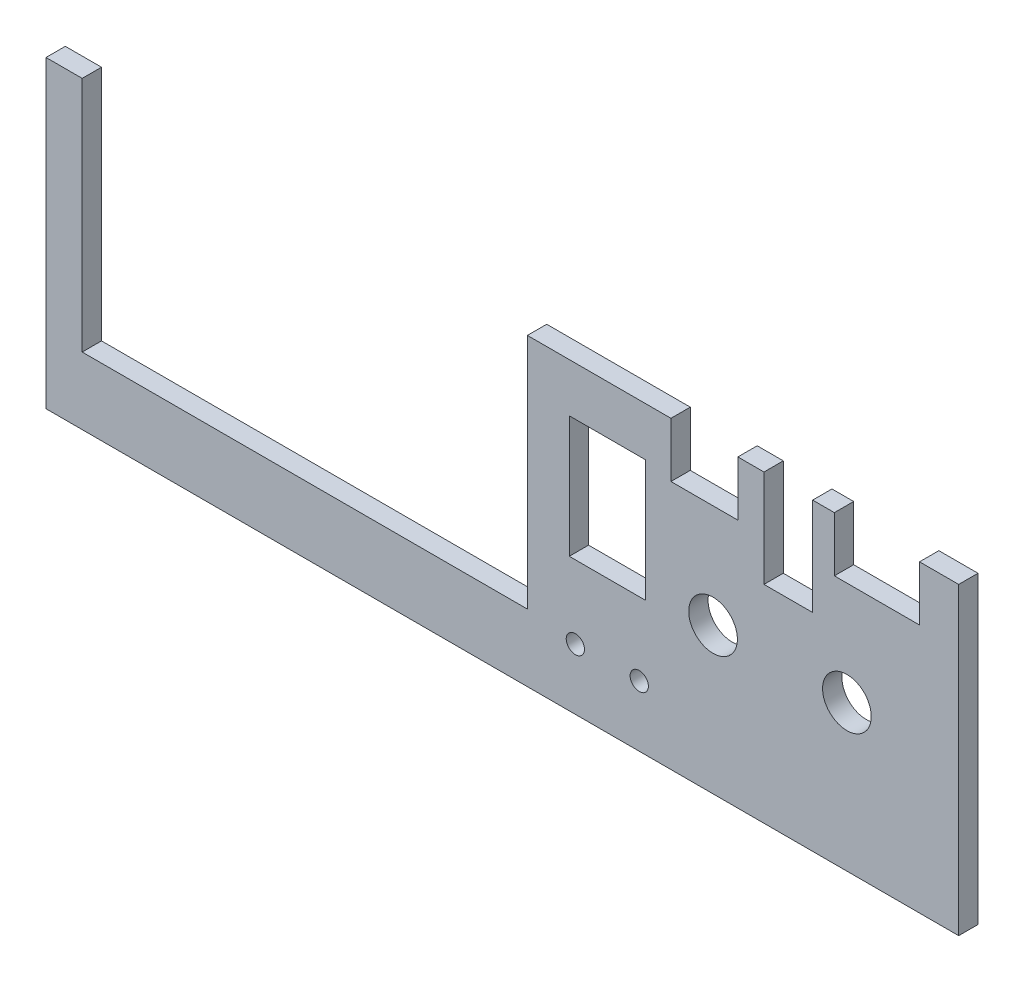
ISO-10303-21;
HEADER;
FILE_DESCRIPTION(('STEP AP214'),'2;1');
FILE_NAME('part.step','',(''),(''),'','','');
FILE_SCHEMA(('AUTOMOTIVE_DESIGN { 1 0 10303 214 1 1 1 1 }'));
ENDSEC;
DATA;
#1=APPLICATION_CONTEXT('core data for automotive mechanical design processes');
#2=APPLICATION_PROTOCOL_DEFINITION('international standard','automotive_design',2000,#1);
#3=PRODUCT_CONTEXT('',#1,'mechanical');
#4=PRODUCT('Part','Part','',(#3));
#5=PRODUCT_RELATED_PRODUCT_CATEGORY('part','',(#4));
#6=PRODUCT_DEFINITION_FORMATION('','',#4);
#7=PRODUCT_DEFINITION_CONTEXT('part definition',#1,'design');
#8=PRODUCT_DEFINITION('design','',#6,#7);
#9=PRODUCT_DEFINITION_SHAPE('','',#8);
#10=(LENGTH_UNIT() NAMED_UNIT(*) SI_UNIT(.MILLI.,.METRE.));
#11=(NAMED_UNIT(*) PLANE_ANGLE_UNIT() SI_UNIT($,.RADIAN.));
#12=(NAMED_UNIT(*) SI_UNIT($,.STERADIAN.) SOLID_ANGLE_UNIT());
#13=UNCERTAINTY_MEASURE_WITH_UNIT(LENGTH_MEASURE(1.E-05),#10,'distance_accuracy_value','');
#14=(GEOMETRIC_REPRESENTATION_CONTEXT(3) GLOBAL_UNCERTAINTY_ASSIGNED_CONTEXT((#13)) GLOBAL_UNIT_ASSIGNED_CONTEXT((#10,
#11,#12)) REPRESENTATION_CONTEXT('',''));
#15=CARTESIAN_POINT('',(0.,0.,0.));
#16=DIRECTION('',(0.,0.,1.));
#17=DIRECTION('',(1.,0.,0.));
#18=AXIS2_PLACEMENT_3D('',#15,#16,#17);
#19=CARTESIAN_POINT('',(0.,0.,3.175));
#20=DIRECTION('',(0.,0.,1.));
#21=DIRECTION('',(1.,0.,0.));
#22=AXIS2_PLACEMENT_3D('',#19,#20,#21);
#23=PLANE('',#22);
#24=CARTESIAN_POINT('',(57.871281099234,24.,3.175));
#25=DIRECTION('',(0.,0.,1.));
#26=DIRECTION('',(1.,0.,0.));
#27=AXIS2_PLACEMENT_3D('',#24,#25,#26);
#28=CIRCLE('',#27,4.00000000000001);
#29=CARTESIAN_POINT('',(61.871281099234,24.,3.175));
#30=VERTEX_POINT('',#29);
#31=EDGE_CURVE('E255',#30,#30,#28,.T.);
#32=ORIENTED_EDGE('',*,*,#31,.F.);
#33=EDGE_LOOP('',(#32));
#34=FACE_BOUND('',#33,.T.);
#35=CARTESIAN_POINT('',(23.7413793103448,10.,3.175));
#36=DIRECTION('',(0.,0.,1.));
#37=DIRECTION('',(1.,0.,0.));
#38=AXIS2_PLACEMENT_3D('',#35,#36,#37);
#39=CIRCLE('',#38,1.5);
#40=CARTESIAN_POINT('',(25.2413793103448,10.,3.175));
#41=VERTEX_POINT('',#40);
#42=EDGE_CURVE('E267',#41,#41,#39,.T.);
#43=ORIENTED_EDGE('',*,*,#42,.F.);
#44=EDGE_LOOP('',(#43));
#45=FACE_BOUND('',#44,.T.);
#46=DIRECTION('',(-1.,0.,0.));
#47=VECTOR('',#46,1.);
#48=CARTESIAN_POINT('',(-67.810407440911,50.,3.175));
#49=LINE('',#48,#47);
#50=CARTESIAN_POINT('',(-67.810407440911,50.,3.175));
#51=VERTEX_POINT('',#50);
#52=CARTESIAN_POINT('',(-73.7586206896551,50.,3.175));
#53=VERTEX_POINT('',#52);
#54=EDGE_CURVE('E201',#51,#53,#49,.T.);
#55=ORIENTED_EDGE('',*,*,#54,.T.);
#56=DIRECTION('',(0.,-1.,0.));
#57=VECTOR('',#56,1.);
#58=CARTESIAN_POINT('',(-73.7586206896551,0.,3.175));
#59=LINE('',#58,#57);
#60=CARTESIAN_POINT('',(-73.7586206896551,0.,3.175));
#61=VERTEX_POINT('',#60);
#62=EDGE_CURVE('E206',#53,#61,#59,.T.);
#63=ORIENTED_EDGE('',*,*,#62,.T.);
#64=DIRECTION('',(-1.,0.,0.));
#65=VECTOR('',#64,1.);
#66=CARTESIAN_POINT('',(0.,0.,3.175));
#67=LINE('',#66,#65);
#68=CARTESIAN_POINT('',(76.2413793103448,0.,3.175));
#69=VERTEX_POINT('',#68);
#70=EDGE_CURVE('E224',#69,#61,#67,.T.);
#71=ORIENTED_EDGE('',*,*,#70,.F.);
#72=DIRECTION('',(0.,-1.,0.));
#73=VECTOR('',#72,1.);
#74=CARTESIAN_POINT('',(76.2413793103448,0.,3.175));
#75=LINE('',#74,#73);
#76=CARTESIAN_POINT('',(76.2413793103448,50.,3.175));
#77=VERTEX_POINT('',#76);
#78=EDGE_CURVE('E229',#77,#69,#75,.T.);
#79=ORIENTED_EDGE('',*,*,#78,.F.);
#80=DIRECTION('',(-1.,0.,0.));
#81=VECTOR('',#80,1.);
#82=CARTESIAN_POINT('',(74.2413793103448,50.,3.175));
#83=LINE('',#82,#81);
#84=CARTESIAN_POINT('',(69.8083492180666,50.,3.175));
#85=VERTEX_POINT('',#84);
#86=EDGE_CURVE('E213',#77,#85,#83,.T.);
#87=ORIENTED_EDGE('',*,*,#86,.T.);
#88=DIRECTION('',(0.,-1.,0.));
#89=VECTOR('',#88,1.);
#90=CARTESIAN_POINT('',(69.8083492180666,50.,3.175));
#91=LINE('',#90,#89);
#92=CARTESIAN_POINT('',(69.8083492180666,41.,3.175));
#93=VERTEX_POINT('',#92);
#94=EDGE_CURVE('E298',#85,#93,#91,.T.);
#95=ORIENTED_EDGE('',*,*,#94,.T.);
#96=DIRECTION('',(-1.,0.,0.));
#97=VECTOR('',#96,1.);
#98=CARTESIAN_POINT('',(69.8083492180666,41.,3.175));
#99=LINE('',#98,#97);
#100=CARTESIAN_POINT('',(55.8083492180666,41.,3.175));
#101=VERTEX_POINT('',#100);
#102=EDGE_CURVE('E300',#93,#101,#99,.T.);
#103=ORIENTED_EDGE('',*,*,#102,.T.);
#104=DIRECTION('',(0.,1.,0.));
#105=VECTOR('',#104,1.);
#106=CARTESIAN_POINT('',(55.8083492180666,41.,3.175));
#107=LINE('',#106,#105);
#108=CARTESIAN_POINT('',(55.8083492180666,50.,3.175));
#109=VERTEX_POINT('',#108);
#110=EDGE_CURVE('E302',#101,#109,#107,.T.);
#111=ORIENTED_EDGE('',*,*,#110,.T.);
#112=DIRECTION('',(-1.,0.,0.));
#113=VECTOR('',#112,1.);
#114=CARTESIAN_POINT('',(55.8083492180666,50.,3.175));
#115=LINE('',#114,#113);
#116=CARTESIAN_POINT('',(52.2413793103449,50.,3.175));
#117=VERTEX_POINT('',#116);
#118=EDGE_CURVE('E304',#109,#117,#115,.T.);
#119=ORIENTED_EDGE('',*,*,#118,.T.);
#120=DIRECTION('',(0.,-1.,0.));
#121=VECTOR('',#120,1.);
#122=CARTESIAN_POINT('',(52.2413793103449,50.,3.175));
#123=LINE('',#122,#121);
#124=CARTESIAN_POINT('',(52.2413793103449,34.,3.175));
#125=VERTEX_POINT('',#124);
#126=EDGE_CURVE('E306',#117,#125,#123,.T.);
#127=ORIENTED_EDGE('',*,*,#126,.T.);
#128=DIRECTION('',(-1.,0.,0.));
#129=VECTOR('',#128,1.);
#130=CARTESIAN_POINT('',(52.2413793103449,34.,3.175));
#131=LINE('',#130,#129);
#132=CARTESIAN_POINT('',(44.2413793103449,34.,3.175));
#133=VERTEX_POINT('',#132);
#134=EDGE_CURVE('E308',#125,#133,#131,.T.);
#135=ORIENTED_EDGE('',*,*,#134,.T.);
#136=DIRECTION('',(0.,1.,0.));
#137=VECTOR('',#136,1.);
#138=CARTESIAN_POINT('',(44.2413793103449,34.,3.175));
#139=LINE('',#138,#137);
#140=CARTESIAN_POINT('',(44.2413793103448,50.,3.175));
#141=VERTEX_POINT('',#140);
#142=EDGE_CURVE('E310',#133,#141,#139,.T.);
#143=ORIENTED_EDGE('',*,*,#142,.T.);
#144=DIRECTION('',(-1.,0.,0.));
#145=VECTOR('',#144,1.);
#146=CARTESIAN_POINT('',(44.2413793103448,50.,3.175));
#147=LINE('',#146,#145);
#148=CARTESIAN_POINT('',(39.9531455670134,50.,3.175));
#149=VERTEX_POINT('',#148);
#150=EDGE_CURVE('E312',#141,#149,#147,.T.);
#151=ORIENTED_EDGE('',*,*,#150,.T.);
#152=DIRECTION('',(0.,-1.,0.));
#153=VECTOR('',#152,1.);
#154=CARTESIAN_POINT('',(39.9531455670134,50.,3.175));
#155=LINE('',#154,#153);
#156=CARTESIAN_POINT('',(39.9531455670134,41.,3.175));
#157=VERTEX_POINT('',#156);
#158=EDGE_CURVE('E314',#149,#157,#155,.T.);
#159=ORIENTED_EDGE('',*,*,#158,.T.);
#160=DIRECTION('',(-1.,0.,0.));
#161=VECTOR('',#160,1.);
#162=CARTESIAN_POINT('',(39.9531455670134,41.,3.175));
#163=LINE('',#162,#161);
#164=CARTESIAN_POINT('',(28.9531455670134,41.,3.175));
#165=VERTEX_POINT('',#164);
#166=EDGE_CURVE('E316',#157,#165,#163,.T.);
#167=ORIENTED_EDGE('',*,*,#166,.T.);
#168=DIRECTION('',(0.,1.,0.));
#169=VECTOR('',#168,1.);
#170=CARTESIAN_POINT('',(28.9531455670134,41.,3.175));
#171=LINE('',#170,#169);
#172=CARTESIAN_POINT('',(28.9531455670134,50.,3.175));
#173=VERTEX_POINT('',#172);
#174=EDGE_CURVE('E318',#165,#173,#171,.T.);
#175=ORIENTED_EDGE('',*,*,#174,.T.);
#176=DIRECTION('',(-1.,0.,0.));
#177=VECTOR('',#176,1.);
#178=CARTESIAN_POINT('',(28.9531455670134,50.,3.175));
#179=LINE('',#178,#177);
#180=CARTESIAN_POINT('',(5.35837424041868,50.,3.175));
#181=VERTEX_POINT('',#180);
#182=EDGE_CURVE('E320',#173,#181,#179,.T.);
#183=ORIENTED_EDGE('',*,*,#182,.T.);
#184=DIRECTION('',(0.,-1.,0.));
#185=VECTOR('',#184,1.);
#186=CARTESIAN_POINT('',(5.35837424041868,50.,3.175));
#187=LINE('',#186,#185);
#188=CARTESIAN_POINT('',(5.35837424041868,11.0458653197198,3.175));
#189=VERTEX_POINT('',#188);
#190=EDGE_CURVE('E322',#181,#189,#187,.T.);
#191=ORIENTED_EDGE('',*,*,#190,.T.);
#192=DIRECTION('',(-1.,0.,0.));
#193=VECTOR('',#192,1.);
#194=CARTESIAN_POINT('',(5.35837424041868,11.0458653197198,3.175));
#195=LINE('',#194,#193);
#196=CARTESIAN_POINT('',(-67.810407440911,11.0458653197198,3.175));
#197=VERTEX_POINT('',#196);
#198=EDGE_CURVE('E324',#189,#197,#195,.T.);
#199=ORIENTED_EDGE('',*,*,#198,.T.);
#200=DIRECTION('',(0.,1.,0.));
#201=VECTOR('',#200,1.);
#202=CARTESIAN_POINT('',(-67.810407440911,11.0458653197198,3.175));
#203=LINE('',#202,#201);
#204=EDGE_CURVE('E209',#197,#51,#203,.T.);
#205=ORIENTED_EDGE('',*,*,#204,.T.);
#206=EDGE_LOOP('',(#55,#63,#71,#79,#87,#95,#103,#111,#119,#127,#135,#143,#151,#159,#167,#175,
#183,#191,#199,#205));
#207=FACE_BOUND('',#206,.T.);
#208=DIRECTION('',(1.,0.,0.));
#209=VECTOR('',#208,1.);
#210=CARTESIAN_POINT('',(12.2413793103448,22.,3.175));
#211=LINE('',#210,#209);
#212=CARTESIAN_POINT('',(12.2413793103448,22.,3.175));
#213=VERTEX_POINT('',#212);
#214=CARTESIAN_POINT('',(24.7413793103448,22.,3.175));
#215=VERTEX_POINT('',#214);
#216=EDGE_CURVE('E274',#213,#215,#211,.T.);
#217=ORIENTED_EDGE('',*,*,#216,.F.);
#218=DIRECTION('',(0.,-1.,0.));
#219=VECTOR('',#218,1.);
#220=CARTESIAN_POINT('',(12.2413793103448,42.,3.175));
#221=LINE('',#220,#219);
#222=CARTESIAN_POINT('',(12.2413793103448,42.,3.175));
#223=VERTEX_POINT('',#222);
#224=EDGE_CURVE('E272',#223,#213,#221,.T.);
#225=ORIENTED_EDGE('',*,*,#224,.F.);
#226=DIRECTION('',(-1.,0.,0.));
#227=VECTOR('',#226,1.);
#228=CARTESIAN_POINT('',(24.7413793103448,42.,3.175));
#229=LINE('',#228,#227);
#230=CARTESIAN_POINT('',(24.7413793103448,42.,3.175));
#231=VERTEX_POINT('',#230);
#232=EDGE_CURVE('E279',#231,#223,#229,.T.);
#233=ORIENTED_EDGE('',*,*,#232,.F.);
#234=DIRECTION('',(0.,1.,0.));
#235=VECTOR('',#234,1.);
#236=CARTESIAN_POINT('',(24.7413793103448,22.,3.175));
#237=LINE('',#236,#235);
#238=EDGE_CURVE('E277',#215,#231,#237,.T.);
#239=ORIENTED_EDGE('',*,*,#238,.F.);
#240=EDGE_LOOP('',(#217,#225,#233,#239));
#241=FACE_BOUND('',#240,.T.);
#242=CARTESIAN_POINT('',(13.2413793103448,10.,3.175));
#243=DIRECTION('',(0.,0.,1.));
#244=DIRECTION('',(1.,0.,0.));
#245=AXIS2_PLACEMENT_3D('',#242,#243,#244);
#246=CIRCLE('',#245,1.5);
#247=CARTESIAN_POINT('',(14.7413793103448,10.,3.175));
#248=VERTEX_POINT('',#247);
#249=EDGE_CURVE('E261',#248,#248,#246,.T.);
#250=ORIENTED_EDGE('',*,*,#249,.F.);
#251=EDGE_LOOP('',(#250));
#252=FACE_BOUND('',#251,.T.);
#253=CARTESIAN_POINT('',(35.871281099234,24.,3.175));
#254=DIRECTION('',(0.,0.,1.));
#255=DIRECTION('',(1.,0.,0.));
#256=AXIS2_PLACEMENT_3D('',#253,#254,#255);
#257=CIRCLE('',#256,4.);
#258=CARTESIAN_POINT('',(39.871281099234,24.,3.175));
#259=VERTEX_POINT('',#258);
#260=EDGE_CURVE('E249',#259,#259,#257,.T.);
#261=ORIENTED_EDGE('',*,*,#260,.F.);
#262=EDGE_LOOP('',(#261));
#263=FACE_BOUND('',#262,.T.);
#264=ADVANCED_FACE('F39',(#34,#45,#207,#241,#252,#263),#23,.T.);
#265=CARTESIAN_POINT('',(0.,0.,0.));
#266=DIRECTION('',(0.,0.,1.));
#267=DIRECTION('',(1.,0.,0.));
#268=AXIS2_PLACEMENT_3D('',#265,#266,#267);
#269=PLANE('',#268);
#270=DIRECTION('',(-1.,0.,0.));
#271=VECTOR('',#270,1.);
#272=CARTESIAN_POINT('',(-67.810407440911,50.,0.));
#273=LINE('',#272,#271);
#274=CARTESIAN_POINT('',(-67.810407440911,50.,0.));
#275=VERTEX_POINT('',#274);
#276=CARTESIAN_POINT('',(-73.7586206896551,50.,0.));
#277=VERTEX_POINT('',#276);
#278=EDGE_CURVE('E219',#275,#277,#273,.T.);
#279=ORIENTED_EDGE('',*,*,#278,.F.);
#280=DIRECTION('',(0.,1.,0.));
#281=VECTOR('',#280,1.);
#282=CARTESIAN_POINT('',(-67.810407440911,11.0458653197198,0.));
#283=LINE('',#282,#281);
#284=CARTESIAN_POINT('',(-67.810407440911,11.0458653197198,0.));
#285=VERTEX_POINT('',#284);
#286=EDGE_CURVE('E214',#285,#275,#283,.T.);
#287=ORIENTED_EDGE('',*,*,#286,.F.);
#288=DIRECTION('',(-1.,0.,0.));
#289=VECTOR('',#288,1.);
#290=CARTESIAN_POINT('',(5.35837424041868,11.0458653197198,0.));
#291=LINE('',#290,#289);
#292=CARTESIAN_POINT('',(5.35837424041868,11.0458653197198,0.));
#293=VERTEX_POINT('',#292);
#294=EDGE_CURVE('E357',#293,#285,#291,.T.);
#295=ORIENTED_EDGE('',*,*,#294,.F.);
#296=DIRECTION('',(0.,-1.,0.));
#297=VECTOR('',#296,1.);
#298=CARTESIAN_POINT('',(5.35837424041868,50.,0.));
#299=LINE('',#298,#297);
#300=CARTESIAN_POINT('',(5.35837424041868,50.,0.));
#301=VERTEX_POINT('',#300);
#302=EDGE_CURVE('E355',#301,#293,#299,.T.);
#303=ORIENTED_EDGE('',*,*,#302,.F.);
#304=DIRECTION('',(-1.,0.,0.));
#305=VECTOR('',#304,1.);
#306=CARTESIAN_POINT('',(28.9531455670134,50.,0.));
#307=LINE('',#306,#305);
#308=CARTESIAN_POINT('',(28.9531455670134,50.,0.));
#309=VERTEX_POINT('',#308);
#310=EDGE_CURVE('E353',#309,#301,#307,.T.);
#311=ORIENTED_EDGE('',*,*,#310,.F.);
#312=DIRECTION('',(0.,1.,0.));
#313=VECTOR('',#312,1.);
#314=CARTESIAN_POINT('',(28.9531455670134,41.,0.));
#315=LINE('',#314,#313);
#316=CARTESIAN_POINT('',(28.9531455670134,41.,0.));
#317=VERTEX_POINT('',#316);
#318=EDGE_CURVE('E351',#317,#309,#315,.T.);
#319=ORIENTED_EDGE('',*,*,#318,.F.);
#320=DIRECTION('',(-1.,0.,0.));
#321=VECTOR('',#320,1.);
#322=CARTESIAN_POINT('',(39.9531455670134,41.,0.));
#323=LINE('',#322,#321);
#324=CARTESIAN_POINT('',(39.9531455670134,41.,0.));
#325=VERTEX_POINT('',#324);
#326=EDGE_CURVE('E349',#325,#317,#323,.T.);
#327=ORIENTED_EDGE('',*,*,#326,.F.);
#328=DIRECTION('',(0.,-1.,0.));
#329=VECTOR('',#328,1.);
#330=CARTESIAN_POINT('',(39.9531455670134,50.,0.));
#331=LINE('',#330,#329);
#332=CARTESIAN_POINT('',(39.9531455670134,50.,0.));
#333=VERTEX_POINT('',#332);
#334=EDGE_CURVE('E347',#333,#325,#331,.T.);
#335=ORIENTED_EDGE('',*,*,#334,.F.);
#336=DIRECTION('',(-1.,0.,0.));
#337=VECTOR('',#336,1.);
#338=CARTESIAN_POINT('',(44.2413793103448,50.,0.));
#339=LINE('',#338,#337);
#340=CARTESIAN_POINT('',(44.2413793103448,50.,0.));
#341=VERTEX_POINT('',#340);
#342=EDGE_CURVE('E345',#341,#333,#339,.T.);
#343=ORIENTED_EDGE('',*,*,#342,.F.);
#344=DIRECTION('',(0.,1.,0.));
#345=VECTOR('',#344,1.);
#346=CARTESIAN_POINT('',(44.2413793103449,34.,0.));
#347=LINE('',#346,#345);
#348=CARTESIAN_POINT('',(44.2413793103449,34.,0.));
#349=VERTEX_POINT('',#348);
#350=EDGE_CURVE('E343',#349,#341,#347,.T.);
#351=ORIENTED_EDGE('',*,*,#350,.F.);
#352=DIRECTION('',(-1.,0.,0.));
#353=VECTOR('',#352,1.);
#354=CARTESIAN_POINT('',(52.2413793103449,34.,0.));
#355=LINE('',#354,#353);
#356=CARTESIAN_POINT('',(52.2413793103449,34.,0.));
#357=VERTEX_POINT('',#356);
#358=EDGE_CURVE('E341',#357,#349,#355,.T.);
#359=ORIENTED_EDGE('',*,*,#358,.F.);
#360=DIRECTION('',(0.,-1.,0.));
#361=VECTOR('',#360,1.);
#362=CARTESIAN_POINT('',(52.2413793103449,50.,0.));
#363=LINE('',#362,#361);
#364=CARTESIAN_POINT('',(52.2413793103449,50.,0.));
#365=VERTEX_POINT('',#364);
#366=EDGE_CURVE('E339',#365,#357,#363,.T.);
#367=ORIENTED_EDGE('',*,*,#366,.F.);
#368=DIRECTION('',(-1.,0.,0.));
#369=VECTOR('',#368,1.);
#370=CARTESIAN_POINT('',(55.8083492180666,50.,0.));
#371=LINE('',#370,#369);
#372=CARTESIAN_POINT('',(55.8083492180666,50.,0.));
#373=VERTEX_POINT('',#372);
#374=EDGE_CURVE('E337',#373,#365,#371,.T.);
#375=ORIENTED_EDGE('',*,*,#374,.F.);
#376=DIRECTION('',(0.,1.,0.));
#377=VECTOR('',#376,1.);
#378=CARTESIAN_POINT('',(55.8083492180666,41.,0.));
#379=LINE('',#378,#377);
#380=CARTESIAN_POINT('',(55.8083492180666,41.,0.));
#381=VERTEX_POINT('',#380);
#382=EDGE_CURVE('E335',#381,#373,#379,.T.);
#383=ORIENTED_EDGE('',*,*,#382,.F.);
#384=DIRECTION('',(-1.,0.,0.));
#385=VECTOR('',#384,1.);
#386=CARTESIAN_POINT('',(69.8083492180666,41.,0.));
#387=LINE('',#386,#385);
#388=CARTESIAN_POINT('',(69.8083492180666,41.,0.));
#389=VERTEX_POINT('',#388);
#390=EDGE_CURVE('E333',#389,#381,#387,.T.);
#391=ORIENTED_EDGE('',*,*,#390,.F.);
#392=DIRECTION('',(0.,-1.,0.));
#393=VECTOR('',#392,1.);
#394=CARTESIAN_POINT('',(69.8083492180666,50.,0.));
#395=LINE('',#394,#393);
#396=CARTESIAN_POINT('',(69.8083492180666,50.,0.));
#397=VERTEX_POINT('',#396);
#398=EDGE_CURVE('E331',#397,#389,#395,.T.);
#399=ORIENTED_EDGE('',*,*,#398,.F.);
#400=DIRECTION('',(-1.,0.,0.));
#401=VECTOR('',#400,1.);
#402=CARTESIAN_POINT('',(74.2413793103448,50.,0.));
#403=LINE('',#402,#401);
#404=CARTESIAN_POINT('',(76.2413793103448,50.,0.));
#405=VERTEX_POINT('',#404);
#406=EDGE_CURVE('E329',#405,#397,#403,.T.);
#407=ORIENTED_EDGE('',*,*,#406,.F.);
#408=DIRECTION('',(0.,-1.,0.));
#409=VECTOR('',#408,1.);
#410=CARTESIAN_POINT('',(76.2413793103448,0.,0.));
#411=LINE('',#410,#409);
#412=CARTESIAN_POINT('',(76.2413793103448,0.,0.));
#413=VERTEX_POINT('',#412);
#414=EDGE_CURVE('E235',#405,#413,#411,.T.);
#415=ORIENTED_EDGE('',*,*,#414,.T.);
#416=DIRECTION('',(-1.,0.,0.));
#417=VECTOR('',#416,1.);
#418=CARTESIAN_POINT('',(0.,0.,0.));
#419=LINE('',#418,#417);
#420=CARTESIAN_POINT('',(-73.7586206896551,0.,0.));
#421=VERTEX_POINT('',#420);
#422=EDGE_CURVE('E230',#413,#421,#419,.T.);
#423=ORIENTED_EDGE('',*,*,#422,.T.);
#424=DIRECTION('',(0.,-1.,0.));
#425=VECTOR('',#424,1.);
#426=CARTESIAN_POINT('',(-73.7586206896551,0.,0.));
#427=LINE('',#426,#425);
#428=EDGE_CURVE('E239',#277,#421,#427,.T.);
#429=ORIENTED_EDGE('',*,*,#428,.F.);
#430=EDGE_LOOP('',(#279,#287,#295,#303,#311,#319,#327,#335,#343,#351,#359,#367,#375,#383,#391,
#399,#407,#415,#423,#429));
#431=FACE_BOUND('',#430,.T.);
#432=DIRECTION('',(0.,-1.,0.));
#433=VECTOR('',#432,1.);
#434=CARTESIAN_POINT('',(12.2413793103448,42.,0.));
#435=LINE('',#434,#433);
#436=CARTESIAN_POINT('',(12.2413793103448,42.,0.));
#437=VERTEX_POINT('',#436);
#438=CARTESIAN_POINT('',(12.2413793103448,22.,0.));
#439=VERTEX_POINT('',#438);
#440=EDGE_CURVE('E62',#437,#439,#435,.T.);
#441=ORIENTED_EDGE('',*,*,#440,.T.);
#442=DIRECTION('',(1.,0.,0.));
#443=VECTOR('',#442,1.);
#444=CARTESIAN_POINT('',(12.2413793103448,22.,0.));
#445=LINE('',#444,#443);
#446=CARTESIAN_POINT('',(24.7413793103448,22.,0.));
#447=VERTEX_POINT('',#446);
#448=EDGE_CURVE('E283',#439,#447,#445,.T.);
#449=ORIENTED_EDGE('',*,*,#448,.T.);
#450=DIRECTION('',(0.,1.,0.));
#451=VECTOR('',#450,1.);
#452=CARTESIAN_POINT('',(24.7413793103448,22.,0.));
#453=LINE('',#452,#451);
#454=CARTESIAN_POINT('',(24.7413793103448,42.,0.));
#455=VERTEX_POINT('',#454);
#456=EDGE_CURVE('E286',#447,#455,#453,.T.);
#457=ORIENTED_EDGE('',*,*,#456,.T.);
#458=DIRECTION('',(-1.,0.,0.));
#459=VECTOR('',#458,1.);
#460=CARTESIAN_POINT('',(24.7413793103448,42.,0.));
#461=LINE('',#460,#459);
#462=EDGE_CURVE('E275',#455,#437,#461,.T.);
#463=ORIENTED_EDGE('',*,*,#462,.T.);
#464=EDGE_LOOP('',(#441,#449,#457,#463));
#465=FACE_BOUND('',#464,.T.);
#466=CARTESIAN_POINT('',(23.7413793103448,10.,0.));
#467=DIRECTION('',(0.,0.,1.));
#468=DIRECTION('',(1.,0.,0.));
#469=AXIS2_PLACEMENT_3D('',#466,#467,#468);
#470=CIRCLE('',#469,1.5);
#471=CARTESIAN_POINT('',(25.2413793103448,10.,0.));
#472=VERTEX_POINT('',#471);
#473=EDGE_CURVE('E264',#472,#472,#470,.T.);
#474=ORIENTED_EDGE('',*,*,#473,.T.);
#475=EDGE_LOOP('',(#474));
#476=FACE_BOUND('',#475,.T.);
#477=CARTESIAN_POINT('',(13.2413793103448,10.,0.));
#478=DIRECTION('',(0.,0.,1.));
#479=DIRECTION('',(1.,0.,0.));
#480=AXIS2_PLACEMENT_3D('',#477,#478,#479);
#481=CIRCLE('',#480,1.5);
#482=CARTESIAN_POINT('',(14.7413793103448,10.,0.));
#483=VERTEX_POINT('',#482);
#484=EDGE_CURVE('E258',#483,#483,#481,.T.);
#485=ORIENTED_EDGE('',*,*,#484,.T.);
#486=EDGE_LOOP('',(#485));
#487=FACE_BOUND('',#486,.T.);
#488=CARTESIAN_POINT('',(57.871281099234,24.,0.));
#489=DIRECTION('',(0.,0.,1.));
#490=DIRECTION('',(1.,0.,0.));
#491=AXIS2_PLACEMENT_3D('',#488,#489,#490);
#492=CIRCLE('',#491,4.00000000000001);
#493=CARTESIAN_POINT('',(61.871281099234,24.,0.));
#494=VERTEX_POINT('',#493);
#495=EDGE_CURVE('E252',#494,#494,#492,.T.);
#496=ORIENTED_EDGE('',*,*,#495,.T.);
#497=EDGE_LOOP('',(#496));
#498=FACE_BOUND('',#497,.T.);
#499=CARTESIAN_POINT('',(35.871281099234,24.,0.));
#500=DIRECTION('',(0.,0.,1.));
#501=DIRECTION('',(1.,0.,0.));
#502=AXIS2_PLACEMENT_3D('',#499,#500,#501);
#503=CIRCLE('',#502,4.);
#504=CARTESIAN_POINT('',(39.871281099234,24.,0.));
#505=VERTEX_POINT('',#504);
#506=EDGE_CURVE('E244',#505,#505,#503,.T.);
#507=ORIENTED_EDGE('',*,*,#506,.T.);
#508=EDGE_LOOP('',(#507));
#509=FACE_BOUND('',#508,.T.);
#510=ADVANCED_FACE('F411',(#431,#465,#476,#487,#498,#509),#269,.F.);
#511=CARTESIAN_POINT('',(-67.810407440911,50.,3.175));
#512=DIRECTION('',(0.,-1.,0.));
#513=DIRECTION('',(0.,0.,-1.));
#514=AXIS2_PLACEMENT_3D('',#511,#512,#513);
#515=PLANE('',#514);
#516=ORIENTED_EDGE('',*,*,#278,.T.);
#517=DIRECTION('',(0.,0.,-1.));
#518=VECTOR('',#517,1.);
#519=CARTESIAN_POINT('',(-73.7586206896551,50.,3.175));
#520=LINE('',#519,#518);
#521=EDGE_CURVE('E217',#53,#277,#520,.T.);
#522=ORIENTED_EDGE('',*,*,#521,.F.);
#523=ORIENTED_EDGE('',*,*,#54,.F.);
#524=DIRECTION('',(0.,0.,-1.));
#525=VECTOR('',#524,1.);
#526=CARTESIAN_POINT('',(-67.810407440911,50.,3.175));
#527=LINE('',#526,#525);
#528=EDGE_CURVE('E327',#51,#275,#527,.T.);
#529=ORIENTED_EDGE('',*,*,#528,.T.);
#530=EDGE_LOOP('',(#516,#522,#523,#529));
#531=FACE_BOUND('',#530,.T.);
#532=ADVANCED_FACE('F41',(#531),#515,.F.);
#533=CARTESIAN_POINT('',(74.2413793103448,50.,3.175));
#534=DIRECTION('',(0.,-1.,0.));
#535=DIRECTION('',(0.,0.,-1.));
#536=AXIS2_PLACEMENT_3D('',#533,#534,#535);
#537=PLANE('',#536);
#538=ORIENTED_EDGE('',*,*,#406,.T.);
#539=DIRECTION('',(0.,0.,-1.));
#540=VECTOR('',#539,1.);
#541=CARTESIAN_POINT('',(69.8083492180666,50.,3.175));
#542=LINE('',#541,#540);
#543=EDGE_CURVE('E11',#85,#397,#542,.T.);
#544=ORIENTED_EDGE('',*,*,#543,.F.);
#545=ORIENTED_EDGE('',*,*,#86,.F.);
#546=DIRECTION('',(0.,0.,-1.));
#547=VECTOR('',#546,1.);
#548=CARTESIAN_POINT('',(76.2413793103448,50.,3.175));
#549=LINE('',#548,#547);
#550=EDGE_CURVE('E223',#77,#405,#549,.T.);
#551=ORIENTED_EDGE('',*,*,#550,.T.);
#552=EDGE_LOOP('',(#538,#544,#545,#551));
#553=FACE_BOUND('',#552,.T.);
#554=ADVANCED_FACE('F429',(#553),#537,.F.);
#555=CARTESIAN_POINT('',(69.8083492180666,50.,3.175));
#556=DIRECTION('',(1.,0.,0.));
#557=DIRECTION('',(0.,0.,-1.));
#558=AXIS2_PLACEMENT_3D('',#555,#556,#557);
#559=PLANE('',#558);
#560=ORIENTED_EDGE('',*,*,#398,.T.);
#561=DIRECTION('',(0.,0.,-1.));
#562=VECTOR('',#561,1.);
#563=CARTESIAN_POINT('',(69.8083492180666,41.,3.175));
#564=LINE('',#563,#562);
#565=EDGE_CURVE('E47',#93,#389,#564,.T.);
#566=ORIENTED_EDGE('',*,*,#565,.F.);
#567=ORIENTED_EDGE('',*,*,#94,.F.);
#568=ORIENTED_EDGE('',*,*,#543,.T.);
#569=EDGE_LOOP('',(#560,#566,#567,#568));
#570=FACE_BOUND('',#569,.T.);
#571=ADVANCED_FACE('F427',(#570),#559,.F.);
#572=CARTESIAN_POINT('',(69.8083492180666,41.,3.175));
#573=DIRECTION('',(0.,-1.,0.));
#574=DIRECTION('',(0.,0.,-1.));
#575=AXIS2_PLACEMENT_3D('',#572,#573,#574);
#576=PLANE('',#575);
#577=ORIENTED_EDGE('',*,*,#390,.T.);
#578=DIRECTION('',(0.,0.,-1.));
#579=VECTOR('',#578,1.);
#580=CARTESIAN_POINT('',(55.8083492180666,41.,3.175));
#581=LINE('',#580,#579);
#582=EDGE_CURVE('E397',#101,#381,#581,.T.);
#583=ORIENTED_EDGE('',*,*,#582,.F.);
#584=ORIENTED_EDGE('',*,*,#102,.F.);
#585=ORIENTED_EDGE('',*,*,#565,.T.);
#586=EDGE_LOOP('',(#577,#583,#584,#585));
#587=FACE_BOUND('',#586,.T.);
#588=ADVANCED_FACE('F404',(#587),#576,.F.);
#589=CARTESIAN_POINT('',(55.8083492180666,41.,3.175));
#590=DIRECTION('',(-1.,0.,0.));
#591=DIRECTION('',(0.,0.,1.));
#592=AXIS2_PLACEMENT_3D('',#589,#590,#591);
#593=PLANE('',#592);
#594=ORIENTED_EDGE('',*,*,#382,.T.);
#595=DIRECTION('',(0.,0.,-1.));
#596=VECTOR('',#595,1.);
#597=CARTESIAN_POINT('',(55.8083492180666,50.,3.175));
#598=LINE('',#597,#596);
#599=EDGE_CURVE('E394',#109,#373,#598,.T.);
#600=ORIENTED_EDGE('',*,*,#599,.F.);
#601=ORIENTED_EDGE('',*,*,#110,.F.);
#602=ORIENTED_EDGE('',*,*,#582,.T.);
#603=EDGE_LOOP('',(#594,#600,#601,#602));
#604=FACE_BOUND('',#603,.T.);
#605=ADVANCED_FACE('F417',(#604),#593,.F.);
#606=CARTESIAN_POINT('',(55.8083492180666,50.,3.175));
#607=DIRECTION('',(0.,-1.,0.));
#608=DIRECTION('',(0.,0.,-1.));
#609=AXIS2_PLACEMENT_3D('',#606,#607,#608);
#610=PLANE('',#609);
#611=ORIENTED_EDGE('',*,*,#374,.T.);
#612=DIRECTION('',(0.,0.,-1.));
#613=VECTOR('',#612,1.);
#614=CARTESIAN_POINT('',(52.2413793103449,50.,3.175));
#615=LINE('',#614,#613);
#616=EDGE_CURVE('E391',#117,#365,#615,.T.);
#617=ORIENTED_EDGE('',*,*,#616,.F.);
#618=ORIENTED_EDGE('',*,*,#118,.F.);
#619=ORIENTED_EDGE('',*,*,#599,.T.);
#620=EDGE_LOOP('',(#611,#617,#618,#619));
#621=FACE_BOUND('',#620,.T.);
#622=ADVANCED_FACE('F421',(#621),#610,.F.);
#623=CARTESIAN_POINT('',(52.2413793103449,50.,3.175));
#624=DIRECTION('',(1.,0.,0.));
#625=DIRECTION('',(0.,0.,-1.));
#626=AXIS2_PLACEMENT_3D('',#623,#624,#625);
#627=PLANE('',#626);
#628=ORIENTED_EDGE('',*,*,#366,.T.);
#629=DIRECTION('',(0.,0.,-1.));
#630=VECTOR('',#629,1.);
#631=CARTESIAN_POINT('',(52.2413793103449,34.,3.175));
#632=LINE('',#631,#630);
#633=EDGE_CURVE('E388',#125,#357,#632,.T.);
#634=ORIENTED_EDGE('',*,*,#633,.F.);
#635=ORIENTED_EDGE('',*,*,#126,.F.);
#636=ORIENTED_EDGE('',*,*,#616,.T.);
#637=EDGE_LOOP('',(#628,#634,#635,#636));
#638=FACE_BOUND('',#637,.T.);
#639=ADVANCED_FACE('F485',(#638),#627,.F.);
#640=CARTESIAN_POINT('',(52.2413793103449,34.,3.175));
#641=DIRECTION('',(0.,-1.,0.));
#642=DIRECTION('',(0.,0.,-1.));
#643=AXIS2_PLACEMENT_3D('',#640,#641,#642);
#644=PLANE('',#643);
#645=ORIENTED_EDGE('',*,*,#358,.T.);
#646=DIRECTION('',(0.,0.,-1.));
#647=VECTOR('',#646,1.);
#648=CARTESIAN_POINT('',(44.2413793103449,34.,3.175));
#649=LINE('',#648,#647);
#650=EDGE_CURVE('E385',#133,#349,#649,.T.);
#651=ORIENTED_EDGE('',*,*,#650,.F.);
#652=ORIENTED_EDGE('',*,*,#134,.F.);
#653=ORIENTED_EDGE('',*,*,#633,.T.);
#654=EDGE_LOOP('',(#645,#651,#652,#653));
#655=FACE_BOUND('',#654,.T.);
#656=ADVANCED_FACE('F482',(#655),#644,.F.);
#657=CARTESIAN_POINT('',(44.2413793103449,34.,3.175));
#658=DIRECTION('',(-1.,0.,0.));
#659=DIRECTION('',(0.,-1.,0.));
#660=AXIS2_PLACEMENT_3D('',#657,#658,#659);
#661=PLANE('',#660);
#662=ORIENTED_EDGE('',*,*,#350,.T.);
#663=DIRECTION('',(0.,0.,-1.));
#664=VECTOR('',#663,1.);
#665=CARTESIAN_POINT('',(44.2413793103448,50.,3.175));
#666=LINE('',#665,#664);
#667=EDGE_CURVE('E382',#141,#341,#666,.T.);
#668=ORIENTED_EDGE('',*,*,#667,.F.);
#669=ORIENTED_EDGE('',*,*,#142,.F.);
#670=ORIENTED_EDGE('',*,*,#650,.T.);
#671=EDGE_LOOP('',(#662,#668,#669,#670));
#672=FACE_BOUND('',#671,.T.);
#673=ADVANCED_FACE('F478',(#672),#661,.F.);
#674=CARTESIAN_POINT('',(44.2413793103448,50.,3.175));
#675=DIRECTION('',(0.,-1.,0.));
#676=DIRECTION('',(0.,0.,-1.));
#677=AXIS2_PLACEMENT_3D('',#674,#675,#676);
#678=PLANE('',#677);
#679=ORIENTED_EDGE('',*,*,#342,.T.);
#680=DIRECTION('',(0.,0.,-1.));
#681=VECTOR('',#680,1.);
#682=CARTESIAN_POINT('',(39.9531455670134,50.,3.175));
#683=LINE('',#682,#681);
#684=EDGE_CURVE('E379',#149,#333,#683,.T.);
#685=ORIENTED_EDGE('',*,*,#684,.F.);
#686=ORIENTED_EDGE('',*,*,#150,.F.);
#687=ORIENTED_EDGE('',*,*,#667,.T.);
#688=EDGE_LOOP('',(#679,#685,#686,#687));
#689=FACE_BOUND('',#688,.T.);
#690=ADVANCED_FACE('F474',(#689),#678,.F.);
#691=CARTESIAN_POINT('',(39.9531455670134,50.,3.175));
#692=DIRECTION('',(1.,0.,0.));
#693=DIRECTION('',(0.,0.,-1.));
#694=AXIS2_PLACEMENT_3D('',#691,#692,#693);
#695=PLANE('',#694);
#696=ORIENTED_EDGE('',*,*,#334,.T.);
#697=DIRECTION('',(0.,0.,-1.));
#698=VECTOR('',#697,1.);
#699=CARTESIAN_POINT('',(39.9531455670134,41.,3.175));
#700=LINE('',#699,#698);
#701=EDGE_CURVE('E376',#157,#325,#700,.T.);
#702=ORIENTED_EDGE('',*,*,#701,.F.);
#703=ORIENTED_EDGE('',*,*,#158,.F.);
#704=ORIENTED_EDGE('',*,*,#684,.T.);
#705=EDGE_LOOP('',(#696,#702,#703,#704));
#706=FACE_BOUND('',#705,.T.);
#707=ADVANCED_FACE('F469',(#706),#695,.F.);
#708=CARTESIAN_POINT('',(39.9531455670134,41.,3.175));
#709=DIRECTION('',(0.,-1.,0.));
#710=DIRECTION('',(0.,0.,-1.));
#711=AXIS2_PLACEMENT_3D('',#708,#709,#710);
#712=PLANE('',#711);
#713=ORIENTED_EDGE('',*,*,#326,.T.);
#714=DIRECTION('',(0.,0.,-1.));
#715=VECTOR('',#714,1.);
#716=CARTESIAN_POINT('',(28.9531455670134,41.,3.175));
#717=LINE('',#716,#715);
#718=EDGE_CURVE('E373',#165,#317,#717,.T.);
#719=ORIENTED_EDGE('',*,*,#718,.F.);
#720=ORIENTED_EDGE('',*,*,#166,.F.);
#721=ORIENTED_EDGE('',*,*,#701,.T.);
#722=EDGE_LOOP('',(#713,#719,#720,#721));
#723=FACE_BOUND('',#722,.T.);
#724=ADVANCED_FACE('F463',(#723),#712,.F.);
#725=CARTESIAN_POINT('',(28.9531455670134,41.,3.175));
#726=DIRECTION('',(-1.,0.,0.));
#727=DIRECTION('',(0.,0.,1.));
#728=AXIS2_PLACEMENT_3D('',#725,#726,#727);
#729=PLANE('',#728);
#730=ORIENTED_EDGE('',*,*,#318,.T.);
#731=DIRECTION('',(0.,0.,-1.));
#732=VECTOR('',#731,1.);
#733=CARTESIAN_POINT('',(28.9531455670134,50.,3.175));
#734=LINE('',#733,#732);
#735=EDGE_CURVE('E370',#173,#309,#734,.T.);
#736=ORIENTED_EDGE('',*,*,#735,.F.);
#737=ORIENTED_EDGE('',*,*,#174,.F.);
#738=ORIENTED_EDGE('',*,*,#718,.T.);
#739=EDGE_LOOP('',(#730,#736,#737,#738));
#740=FACE_BOUND('',#739,.T.);
#741=ADVANCED_FACE('F459',(#740),#729,.F.);
#742=CARTESIAN_POINT('',(28.9531455670134,50.,3.175));
#743=DIRECTION('',(0.,-1.,0.));
#744=DIRECTION('',(0.,0.,-1.));
#745=AXIS2_PLACEMENT_3D('',#742,#743,#744);
#746=PLANE('',#745);
#747=ORIENTED_EDGE('',*,*,#310,.T.);
#748=DIRECTION('',(0.,0.,-1.));
#749=VECTOR('',#748,1.);
#750=CARTESIAN_POINT('',(5.35837424041868,50.,3.175));
#751=LINE('',#750,#749);
#752=EDGE_CURVE('E367',#181,#301,#751,.T.);
#753=ORIENTED_EDGE('',*,*,#752,.F.);
#754=ORIENTED_EDGE('',*,*,#182,.F.);
#755=ORIENTED_EDGE('',*,*,#735,.T.);
#756=EDGE_LOOP('',(#747,#753,#754,#755));
#757=FACE_BOUND('',#756,.T.);
#758=ADVANCED_FACE('F454',(#757),#746,.F.);
#759=CARTESIAN_POINT('',(5.35837424041868,50.,3.175));
#760=DIRECTION('',(1.,0.,0.));
#761=DIRECTION('',(0.,0.,-1.));
#762=AXIS2_PLACEMENT_3D('',#759,#760,#761);
#763=PLANE('',#762);
#764=ORIENTED_EDGE('',*,*,#302,.T.);
#765=DIRECTION('',(0.,0.,-1.));
#766=VECTOR('',#765,1.);
#767=CARTESIAN_POINT('',(5.35837424041868,11.0458653197198,3.175));
#768=LINE('',#767,#766);
#769=EDGE_CURVE('E364',#189,#293,#768,.T.);
#770=ORIENTED_EDGE('',*,*,#769,.F.);
#771=ORIENTED_EDGE('',*,*,#190,.F.);
#772=ORIENTED_EDGE('',*,*,#752,.T.);
#773=EDGE_LOOP('',(#764,#770,#771,#772));
#774=FACE_BOUND('',#773,.T.);
#775=ADVANCED_FACE('F448',(#774),#763,.F.);
#776=CARTESIAN_POINT('',(5.35837424041868,11.0458653197198,3.175));
#777=DIRECTION('',(0.,-1.,0.));
#778=DIRECTION('',(0.,0.,-1.));
#779=AXIS2_PLACEMENT_3D('',#776,#777,#778);
#780=PLANE('',#779);
#781=ORIENTED_EDGE('',*,*,#294,.T.);
#782=DIRECTION('',(0.,0.,-1.));
#783=VECTOR('',#782,1.);
#784=CARTESIAN_POINT('',(-67.810407440911,11.0458653197198,3.175));
#785=LINE('',#784,#783);
#786=EDGE_CURVE('E361',#197,#285,#785,.T.);
#787=ORIENTED_EDGE('',*,*,#786,.F.);
#788=ORIENTED_EDGE('',*,*,#198,.F.);
#789=ORIENTED_EDGE('',*,*,#769,.T.);
#790=EDGE_LOOP('',(#781,#787,#788,#789));
#791=FACE_BOUND('',#790,.T.);
#792=ADVANCED_FACE('F444',(#791),#780,.F.);
#793=CARTESIAN_POINT('',(-67.810407440911,11.0458653197198,3.175));
#794=DIRECTION('',(-1.,0.,0.));
#795=DIRECTION('',(0.,0.,1.));
#796=AXIS2_PLACEMENT_3D('',#793,#794,#795);
#797=PLANE('',#796);
#798=ORIENTED_EDGE('',*,*,#286,.T.);
#799=ORIENTED_EDGE('',*,*,#528,.F.);
#800=ORIENTED_EDGE('',*,*,#204,.F.);
#801=ORIENTED_EDGE('',*,*,#786,.T.);
#802=EDGE_LOOP('',(#798,#799,#800,#801));
#803=FACE_BOUND('',#802,.T.);
#804=ADVANCED_FACE('F440',(#803),#797,.F.);
#805=CARTESIAN_POINT('',(12.2413793103448,42.,3.175));
#806=DIRECTION('',(1.,0.,0.));
#807=DIRECTION('',(0.,0.,-1.));
#808=AXIS2_PLACEMENT_3D('',#805,#806,#807);
#809=PLANE('',#808);
#810=ORIENTED_EDGE('',*,*,#440,.F.);
#811=DIRECTION('',(0.,0.,-1.));
#812=VECTOR('',#811,1.);
#813=CARTESIAN_POINT('',(12.2413793103448,42.,3.175));
#814=LINE('',#813,#812);
#815=EDGE_CURVE('E281',#223,#437,#814,.T.);
#816=ORIENTED_EDGE('',*,*,#815,.F.);
#817=ORIENTED_EDGE('',*,*,#224,.T.);
#818=DIRECTION('',(0.,0.,-1.));
#819=VECTOR('',#818,1.);
#820=CARTESIAN_POINT('',(12.2413793103448,22.,3.175));
#821=LINE('',#820,#819);
#822=EDGE_CURVE('E295',#213,#439,#821,.T.);
#823=ORIENTED_EDGE('',*,*,#822,.T.);
#824=EDGE_LOOP('',(#810,#816,#817,#823));
#825=FACE_BOUND('',#824,.T.);
#826=ADVANCED_FACE('F504',(#825),#809,.T.);
#827=CARTESIAN_POINT('',(12.2413793103448,22.,3.175));
#828=DIRECTION('',(0.,1.,0.));
#829=DIRECTION('',(-1.,0.,0.));
#830=AXIS2_PLACEMENT_3D('',#827,#828,#829);
#831=PLANE('',#830);
#832=ORIENTED_EDGE('',*,*,#448,.F.);
#833=ORIENTED_EDGE('',*,*,#822,.F.);
#834=ORIENTED_EDGE('',*,*,#216,.T.);
#835=DIRECTION('',(0.,0.,-1.));
#836=VECTOR('',#835,1.);
#837=CARTESIAN_POINT('',(24.7413793103448,22.,3.175));
#838=LINE('',#837,#836);
#839=EDGE_CURVE('E293',#215,#447,#838,.T.);
#840=ORIENTED_EDGE('',*,*,#839,.T.);
#841=EDGE_LOOP('',(#832,#833,#834,#840));
#842=FACE_BOUND('',#841,.T.);
#843=ADVANCED_FACE('F566',(#842),#831,.T.);
#844=CARTESIAN_POINT('',(24.7413793103448,22.,3.175));
#845=DIRECTION('',(-1.,0.,0.));
#846=DIRECTION('',(0.,-1.,0.));
#847=AXIS2_PLACEMENT_3D('',#844,#845,#846);
#848=PLANE('',#847);
#849=ORIENTED_EDGE('',*,*,#456,.F.);
#850=ORIENTED_EDGE('',*,*,#839,.F.);
#851=ORIENTED_EDGE('',*,*,#238,.T.);
#852=DIRECTION('',(0.,0.,-1.));
#853=VECTOR('',#852,1.);
#854=CARTESIAN_POINT('',(24.7413793103448,42.,3.175));
#855=LINE('',#854,#853);
#856=EDGE_CURVE('E54',#231,#455,#855,.T.);
#857=ORIENTED_EDGE('',*,*,#856,.T.);
#858=EDGE_LOOP('',(#849,#850,#851,#857));
#859=FACE_BOUND('',#858,.T.);
#860=ADVANCED_FACE('F572',(#859),#848,.T.);
#861=CARTESIAN_POINT('',(24.7413793103448,42.,3.175));
#862=DIRECTION('',(0.,-1.,0.));
#863=DIRECTION('',(0.,0.,-1.));
#864=AXIS2_PLACEMENT_3D('',#861,#862,#863);
#865=PLANE('',#864);
#866=ORIENTED_EDGE('',*,*,#462,.F.);
#867=ORIENTED_EDGE('',*,*,#856,.F.);
#868=ORIENTED_EDGE('',*,*,#232,.T.);
#869=ORIENTED_EDGE('',*,*,#815,.T.);
#870=EDGE_LOOP('',(#866,#867,#868,#869));
#871=FACE_BOUND('',#870,.T.);
#872=ADVANCED_FACE('F579',(#871),#865,.T.);
#873=CARTESIAN_POINT('',(23.7413793103448,10.,3.175));
#874=DIRECTION('',(0.,0.,-1.));
#875=DIRECTION('',(-1.,0.,0.));
#876=AXIS2_PLACEMENT_3D('',#873,#874,#875);
#877=CYLINDRICAL_SURFACE('',#876,1.5);
#878=ORIENTED_EDGE('',*,*,#42,.T.);
#879=EDGE_LOOP('',(#878));
#880=FACE_BOUND('',#879,.T.);
#881=ORIENTED_EDGE('',*,*,#473,.F.);
#882=EDGE_LOOP('',(#881));
#883=FACE_BOUND('',#882,.T.);
#884=ADVANCED_FACE('F587',(#880,#883),#877,.F.);
#885=CARTESIAN_POINT('',(13.2413793103448,10.,3.175));
#886=DIRECTION('',(0.,0.,-1.));
#887=DIRECTION('',(-1.,0.,0.));
#888=AXIS2_PLACEMENT_3D('',#885,#886,#887);
#889=CYLINDRICAL_SURFACE('',#888,1.5);
#890=ORIENTED_EDGE('',*,*,#249,.T.);
#891=EDGE_LOOP('',(#890));
#892=FACE_BOUND('',#891,.T.);
#893=ORIENTED_EDGE('',*,*,#484,.F.);
#894=EDGE_LOOP('',(#893));
#895=FACE_BOUND('',#894,.T.);
#896=ADVANCED_FACE('F594',(#892,#895),#889,.F.);
#897=CARTESIAN_POINT('',(57.871281099234,24.,3.175));
#898=DIRECTION('',(0.,0.,-1.));
#899=DIRECTION('',(-1.,0.,0.));
#900=AXIS2_PLACEMENT_3D('',#897,#898,#899);
#901=CYLINDRICAL_SURFACE('',#900,4.00000000000001);
#902=ORIENTED_EDGE('',*,*,#31,.T.);
#903=EDGE_LOOP('',(#902));
#904=FACE_BOUND('',#903,.T.);
#905=ORIENTED_EDGE('',*,*,#495,.F.);
#906=EDGE_LOOP('',(#905));
#907=FACE_BOUND('',#906,.T.);
#908=ADVANCED_FACE('F602',(#904,#907),#901,.F.);
#909=CARTESIAN_POINT('',(35.871281099234,24.,3.175));
#910=DIRECTION('',(0.,0.,-1.));
#911=DIRECTION('',(-1.,0.,0.));
#912=AXIS2_PLACEMENT_3D('',#909,#910,#911);
#913=CYLINDRICAL_SURFACE('',#912,4.);
#914=ORIENTED_EDGE('',*,*,#260,.T.);
#915=EDGE_LOOP('',(#914));
#916=FACE_BOUND('',#915,.T.);
#917=ORIENTED_EDGE('',*,*,#506,.F.);
#918=EDGE_LOOP('',(#917));
#919=FACE_BOUND('',#918,.T.);
#920=ADVANCED_FACE('F610',(#916,#919),#913,.F.);
#921=CARTESIAN_POINT('',(-73.7586206896551,0.,3.175));
#922=DIRECTION('',(1.,0.,0.));
#923=DIRECTION('',(0.,0.,-1.));
#924=AXIS2_PLACEMENT_3D('',#921,#922,#923);
#925=PLANE('',#924);
#926=ORIENTED_EDGE('',*,*,#428,.T.);
#927=DIRECTION('',(0.,0.,-1.));
#928=VECTOR('',#927,1.);
#929=CARTESIAN_POINT('',(-73.7586206896551,0.,3.175));
#930=LINE('',#929,#928);
#931=EDGE_CURVE('E227',#61,#421,#930,.T.);
#932=ORIENTED_EDGE('',*,*,#931,.F.);
#933=ORIENTED_EDGE('',*,*,#62,.F.);
#934=ORIENTED_EDGE('',*,*,#521,.T.);
#935=EDGE_LOOP('',(#926,#932,#933,#934));
#936=FACE_BOUND('',#935,.T.);
#937=ADVANCED_FACE('F226',(#936),#925,.F.);
#938=CARTESIAN_POINT('',(0.,0.,3.175));
#939=DIRECTION('',(0.,-1.,0.));
#940=DIRECTION('',(0.,0.,-1.));
#941=AXIS2_PLACEMENT_3D('',#938,#939,#940);
#942=PLANE('',#941);
#943=ORIENTED_EDGE('',*,*,#422,.F.);
#944=DIRECTION('',(0.,0.,-1.));
#945=VECTOR('',#944,1.);
#946=CARTESIAN_POINT('',(76.2413793103448,0.,3.175));
#947=LINE('',#946,#945);
#948=EDGE_CURVE('E245',#69,#413,#947,.T.);
#949=ORIENTED_EDGE('',*,*,#948,.F.);
#950=ORIENTED_EDGE('',*,*,#70,.T.);
#951=ORIENTED_EDGE('',*,*,#931,.T.);
#952=EDGE_LOOP('',(#943,#949,#950,#951));
#953=FACE_BOUND('',#952,.T.);
#954=ADVANCED_FACE('F435',(#953),#942,.T.);
#955=CARTESIAN_POINT('',(76.2413793103448,0.,3.175));
#956=DIRECTION('',(1.,0.,0.));
#957=DIRECTION('',(0.,0.,-1.));
#958=AXIS2_PLACEMENT_3D('',#955,#956,#957);
#959=PLANE('',#958);
#960=ORIENTED_EDGE('',*,*,#414,.F.);
#961=ORIENTED_EDGE('',*,*,#550,.F.);
#962=ORIENTED_EDGE('',*,*,#78,.T.);
#963=ORIENTED_EDGE('',*,*,#948,.T.);
#964=EDGE_LOOP('',(#960,#961,#962,#963));
#965=FACE_BOUND('',#964,.T.);
#966=ADVANCED_FACE('F632',(#965),#959,.T.);
#967=CLOSED_SHELL('',(#264,#510,#532,#554,#571,#588,#605,#622,#639,#656,#673,#690,#707,#724,
#741,#758,#775,#792,#804,#826,#843,#860,#872,#884,#896,#908,#920,#937,#954,#966));
#968=MANIFOLD_SOLID_BREP('B2',#967);
#969=ADVANCED_BREP_SHAPE_REPRESENTATION('',(#18,#968),#14);
#970=SHAPE_DEFINITION_REPRESENTATION(#9,#969);
ENDSEC;
END-ISO-10303-21;
